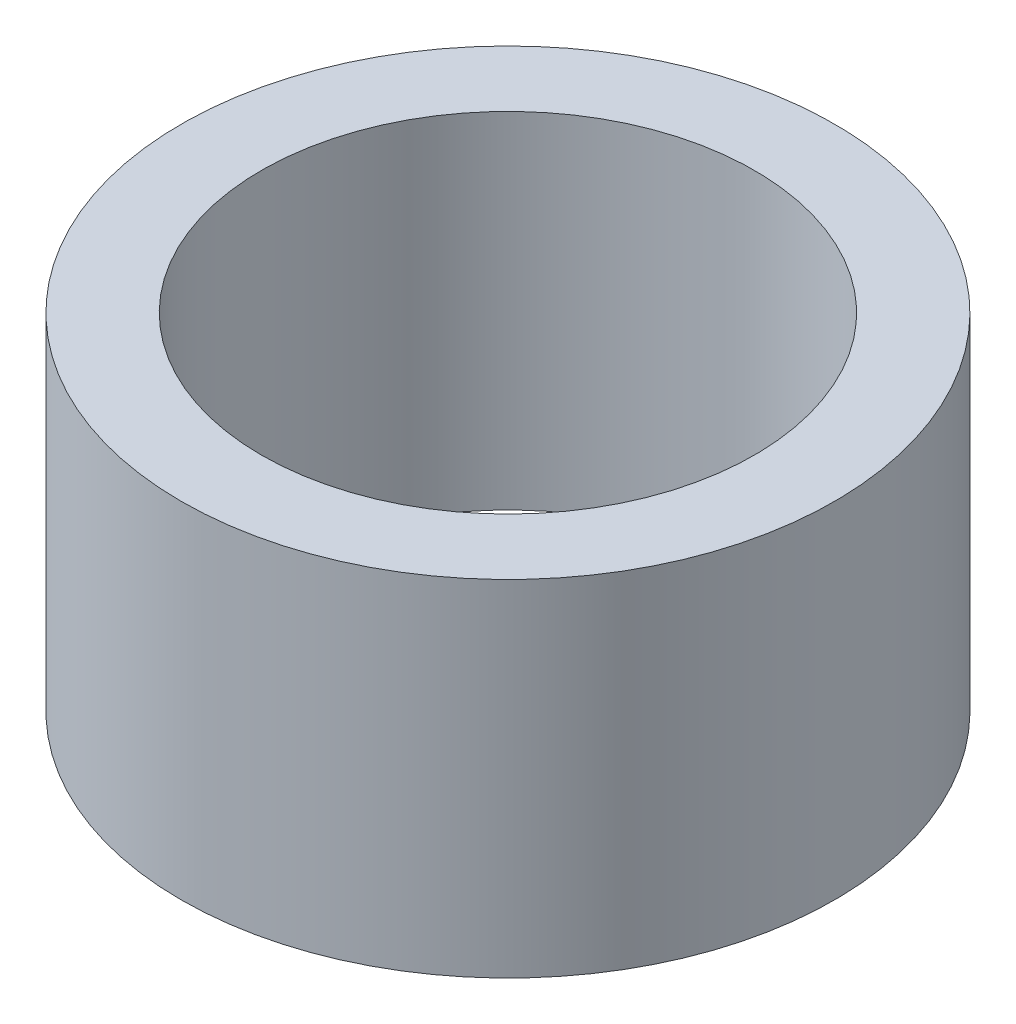
ISO-10303-21;
HEADER;
FILE_DESCRIPTION(('STEP AP214'),'2;1');
FILE_NAME('part.step','',(''),(''),'','','');
FILE_SCHEMA(('AUTOMOTIVE_DESIGN { 1 0 10303 214 1 1 1 1 }'));
ENDSEC;
DATA;
#1=APPLICATION_CONTEXT('core data for automotive mechanical design processes');
#2=APPLICATION_PROTOCOL_DEFINITION('international standard','automotive_design',2000,#1);
#3=PRODUCT_CONTEXT('',#1,'mechanical');
#4=PRODUCT('Part','Part','',(#3));
#5=PRODUCT_RELATED_PRODUCT_CATEGORY('part','',(#4));
#6=PRODUCT_DEFINITION_FORMATION('','',#4);
#7=PRODUCT_DEFINITION_CONTEXT('part definition',#1,'design');
#8=PRODUCT_DEFINITION('design','',#6,#7);
#9=PRODUCT_DEFINITION_SHAPE('','',#8);
#10=(LENGTH_UNIT() NAMED_UNIT(*) SI_UNIT(.MILLI.,.METRE.));
#11=(NAMED_UNIT(*) PLANE_ANGLE_UNIT() SI_UNIT($,.RADIAN.));
#12=(NAMED_UNIT(*) SI_UNIT($,.STERADIAN.) SOLID_ANGLE_UNIT());
#13=UNCERTAINTY_MEASURE_WITH_UNIT(LENGTH_MEASURE(1.E-05),#10,'distance_accuracy_value','');
#14=(GEOMETRIC_REPRESENTATION_CONTEXT(3) GLOBAL_UNCERTAINTY_ASSIGNED_CONTEXT((#13)) GLOBAL_UNIT_ASSIGNED_CONTEXT((#10,
#11,#12)) REPRESENTATION_CONTEXT('',''));
#15=CARTESIAN_POINT('',(0.,0.,0.));
#16=DIRECTION('',(0.,0.,1.));
#17=DIRECTION('',(1.,0.,0.));
#18=AXIS2_PLACEMENT_3D('',#15,#16,#17);
#19=CARTESIAN_POINT('',(0.,14.,0.));
#20=DIRECTION('',(0.,1.,0.));
#21=DIRECTION('',(0.,0.,1.));
#22=AXIS2_PLACEMENT_3D('',#19,#20,#21);
#23=PLANE('',#22);
#24=CARTESIAN_POINT('',(0.,14.,0.));
#25=DIRECTION('',(0.,1.,0.));
#26=DIRECTION('',(0.,0.,1.));
#27=AXIS2_PLACEMENT_3D('',#24,#25,#26);
#28=CIRCLE('',#27,13.25);
#29=CARTESIAN_POINT('',(0.,14.,13.25));
#30=VERTEX_POINT('',#29);
#31=EDGE_CURVE('E10',#30,#30,#28,.T.);
#32=ORIENTED_EDGE('',*,*,#31,.T.);
#33=EDGE_LOOP('',(#32));
#34=FACE_BOUND('',#33,.T.);
#35=CARTESIAN_POINT('',(0.,14.,0.));
#36=DIRECTION('',(0.,1.,0.));
#37=DIRECTION('',(0.,0.,1.));
#38=AXIS2_PLACEMENT_3D('',#35,#36,#37);
#39=CIRCLE('',#38,10.);
#40=CARTESIAN_POINT('',(0.,14.,10.));
#41=VERTEX_POINT('',#40);
#42=EDGE_CURVE('E42',#41,#41,#39,.T.);
#43=ORIENTED_EDGE('',*,*,#42,.F.);
#44=EDGE_LOOP('',(#43));
#45=FACE_BOUND('',#44,.T.);
#46=ADVANCED_FACE('F31',(#34,#45),#23,.T.);
#47=CARTESIAN_POINT('',(0.,0.,0.));
#48=DIRECTION('',(0.,1.,0.));
#49=DIRECTION('',(0.,0.,1.));
#50=AXIS2_PLACEMENT_3D('',#47,#48,#49);
#51=PLANE('',#50);
#52=CARTESIAN_POINT('',(0.,0.,0.));
#53=DIRECTION('',(0.,1.,0.));
#54=DIRECTION('',(0.,0.,1.));
#55=AXIS2_PLACEMENT_3D('',#52,#53,#54);
#56=CIRCLE('',#55,13.25);
#57=CARTESIAN_POINT('',(0.,0.,13.25));
#58=VERTEX_POINT('',#57);
#59=EDGE_CURVE('E35',#58,#58,#56,.T.);
#60=ORIENTED_EDGE('',*,*,#59,.F.);
#61=EDGE_LOOP('',(#60));
#62=FACE_BOUND('',#61,.T.);
#63=CARTESIAN_POINT('',(0.,0.,0.));
#64=DIRECTION('',(0.,1.,0.));
#65=DIRECTION('',(0.,0.,1.));
#66=AXIS2_PLACEMENT_3D('',#63,#64,#65);
#67=CIRCLE('',#66,10.);
#68=CARTESIAN_POINT('',(0.,0.,10.));
#69=VERTEX_POINT('',#68);
#70=EDGE_CURVE('E44',#69,#69,#67,.T.);
#71=ORIENTED_EDGE('',*,*,#70,.T.);
#72=EDGE_LOOP('',(#71));
#73=FACE_BOUND('',#72,.T.);
#74=ADVANCED_FACE('F54',(#62,#73),#51,.F.);
#75=CARTESIAN_POINT('',(0.,14.,0.));
#76=DIRECTION('',(0.,-1.,0.));
#77=DIRECTION('',(0.,0.,-1.));
#78=AXIS2_PLACEMENT_3D('',#75,#76,#77);
#79=CYLINDRICAL_SURFACE('',#78,13.25);
#80=ORIENTED_EDGE('',*,*,#31,.F.);
#81=EDGE_LOOP('',(#80));
#82=FACE_BOUND('',#81,.T.);
#83=ORIENTED_EDGE('',*,*,#59,.T.);
#84=EDGE_LOOP('',(#83));
#85=FACE_BOUND('',#84,.T.);
#86=ADVANCED_FACE('F33',(#82,#85),#79,.T.);
#87=CARTESIAN_POINT('',(0.,14.,0.));
#88=DIRECTION('',(0.,-1.,0.));
#89=DIRECTION('',(0.,0.,-1.));
#90=AXIS2_PLACEMENT_3D('',#87,#88,#89);
#91=CYLINDRICAL_SURFACE('',#90,10.);
#92=ORIENTED_EDGE('',*,*,#42,.T.);
#93=EDGE_LOOP('',(#92));
#94=FACE_BOUND('',#93,.T.);
#95=ORIENTED_EDGE('',*,*,#70,.F.);
#96=EDGE_LOOP('',(#95));
#97=FACE_BOUND('',#96,.T.);
#98=ADVANCED_FACE('F50',(#94,#97),#91,.F.);
#99=CLOSED_SHELL('',(#46,#74,#86,#98));
#100=MANIFOLD_SOLID_BREP('B2',#99);
#101=ADVANCED_BREP_SHAPE_REPRESENTATION('',(#18,#100),#14);
#102=SHAPE_DEFINITION_REPRESENTATION(#9,#101);
ENDSEC;
END-ISO-10303-21;
